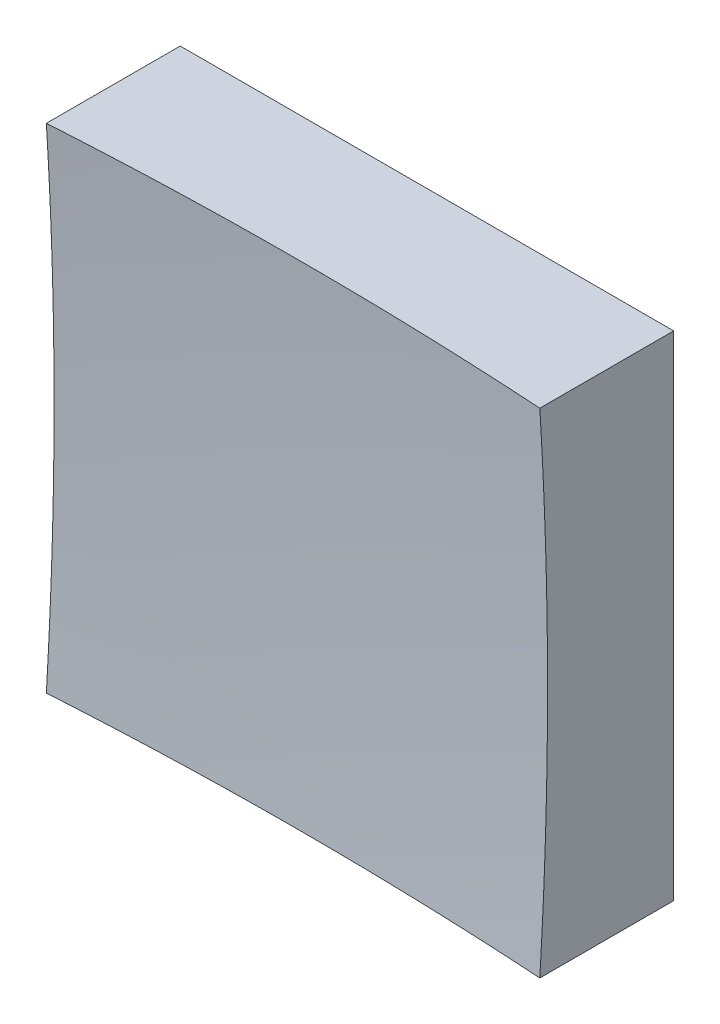
ISO-10303-21;
HEADER;
FILE_DESCRIPTION(('STEP AP214'),'2;1');
FILE_NAME('part.step','',(''),(''),'','','');
FILE_SCHEMA(('AUTOMOTIVE_DESIGN { 1 0 10303 214 1 1 1 1 }'));
ENDSEC;
DATA;
#1=APPLICATION_CONTEXT('core data for automotive mechanical design processes');
#2=APPLICATION_PROTOCOL_DEFINITION('international standard','automotive_design',2000,#1);
#3=PRODUCT_CONTEXT('',#1,'mechanical');
#4=PRODUCT('Part','Part','',(#3));
#5=PRODUCT_RELATED_PRODUCT_CATEGORY('part','',(#4));
#6=PRODUCT_DEFINITION_FORMATION('','',#4);
#7=PRODUCT_DEFINITION_CONTEXT('part definition',#1,'design');
#8=PRODUCT_DEFINITION('design','',#6,#7);
#9=PRODUCT_DEFINITION_SHAPE('','',#8);
#10=(LENGTH_UNIT() NAMED_UNIT(*) SI_UNIT(.MILLI.,.METRE.));
#11=(NAMED_UNIT(*) PLANE_ANGLE_UNIT() SI_UNIT($,.RADIAN.));
#12=(NAMED_UNIT(*) SI_UNIT($,.STERADIAN.) SOLID_ANGLE_UNIT());
#13=UNCERTAINTY_MEASURE_WITH_UNIT(LENGTH_MEASURE(1.E-05),#10,'distance_accuracy_value','');
#14=(GEOMETRIC_REPRESENTATION_CONTEXT(3) GLOBAL_UNCERTAINTY_ASSIGNED_CONTEXT((#13)) GLOBAL_UNIT_ASSIGNED_CONTEXT((#10,
#11,#12)) REPRESENTATION_CONTEXT('',''));
#15=CARTESIAN_POINT('',(0.,0.,0.));
#16=DIRECTION('',(0.,0.,1.));
#17=DIRECTION('',(1.,0.,0.));
#18=AXIS2_PLACEMENT_3D('',#15,#16,#17);
#19=CARTESIAN_POINT('',(-12.5,12.5,20.));
#20=DIRECTION('',(0.,1.,0.));
#21=DIRECTION('',(0.,0.,1.));
#22=AXIS2_PLACEMENT_3D('',#19,#20,#21);
#23=PLANE('',#22);
#24=CARTESIAN_POINT('',(0.,12.5,206.));
#25=DIRECTION('',(0.,1.,0.));
#26=DIRECTION('',(0.,0.,1.));
#27=AXIS2_PLACEMENT_3D('',#24,#25,#26);
#28=CIRCLE('',#27,199.608992783391);
#29=CARTESIAN_POINT('',(12.5,12.5,6.78278186863465));
#30=VERTEX_POINT('',#29);
#31=CARTESIAN_POINT('',(-12.5,12.5,6.78278186863465));
#32=VERTEX_POINT('',#31);
#33=EDGE_CURVE('E79',#30,#32,#28,.T.);
#34=ORIENTED_EDGE('',*,*,#33,.F.);
#35=DIRECTION('',(0.,0.,-1.));
#36=VECTOR('',#35,1.);
#37=CARTESIAN_POINT('',(12.5,12.5,20.));
#38=LINE('',#37,#36);
#39=CARTESIAN_POINT('',(12.5,12.5,0.));
#40=VERTEX_POINT('',#39);
#41=EDGE_CURVE('E85',#30,#40,#38,.T.);
#42=ORIENTED_EDGE('',*,*,#41,.T.);
#43=DIRECTION('',(1.,0.,0.));
#44=VECTOR('',#43,1.);
#45=CARTESIAN_POINT('',(-12.5,12.5,0.));
#46=LINE('',#45,#44);
#47=CARTESIAN_POINT('',(-12.5,12.5,0.));
#48=VERTEX_POINT('',#47);
#49=EDGE_CURVE('E88',#48,#40,#46,.T.);
#50=ORIENTED_EDGE('',*,*,#49,.F.);
#51=DIRECTION('',(0.,0.,-1.));
#52=VECTOR('',#51,1.);
#53=CARTESIAN_POINT('',(-12.5,12.5,20.));
#54=LINE('',#53,#52);
#55=EDGE_CURVE('E47',#32,#48,#54,.T.);
#56=ORIENTED_EDGE('',*,*,#55,.F.);
#57=EDGE_LOOP('',(#34,#42,#50,#56));
#58=FACE_BOUND('',#57,.T.);
#59=ADVANCED_FACE('F39',(#58),#23,.T.);
#60=CARTESIAN_POINT('',(-12.5,12.5,20.));
#61=DIRECTION('',(1.,0.,0.));
#62=DIRECTION('',(0.,1.,0.));
#63=AXIS2_PLACEMENT_3D('',#60,#61,#62);
#64=PLANE('',#63);
#65=DIRECTION('',(0.,0.,-1.));
#66=VECTOR('',#65,1.);
#67=CARTESIAN_POINT('',(-12.5,-12.5,20.));
#68=LINE('',#67,#66);
#69=CARTESIAN_POINT('',(-12.5,-12.5,6.78278186863465));
#70=VERTEX_POINT('',#69);
#71=CARTESIAN_POINT('',(-12.5,-12.5,0.));
#72=VERTEX_POINT('',#71);
#73=EDGE_CURVE('E100',#70,#72,#68,.T.);
#74=ORIENTED_EDGE('',*,*,#73,.F.);
#75=CARTESIAN_POINT('',(-12.5,0.,206.));
#76=DIRECTION('',(1.,0.,0.));
#77=DIRECTION('',(0.,1.,0.));
#78=AXIS2_PLACEMENT_3D('',#75,#76,#77);
#79=CIRCLE('',#78,199.608992783391);
#80=EDGE_CURVE('E89',#70,#32,#79,.T.);
#81=ORIENTED_EDGE('',*,*,#80,.T.);
#82=ORIENTED_EDGE('',*,*,#55,.T.);
#83=DIRECTION('',(0.,-1.,0.));
#84=VECTOR('',#83,1.);
#85=CARTESIAN_POINT('',(-12.5,12.5,0.));
#86=LINE('',#85,#84);
#87=EDGE_CURVE('E97',#48,#72,#86,.T.);
#88=ORIENTED_EDGE('',*,*,#87,.T.);
#89=EDGE_LOOP('',(#74,#81,#82,#88));
#90=FACE_BOUND('',#89,.T.);
#91=ADVANCED_FACE('F122',(#90),#64,.F.);
#92=CARTESIAN_POINT('',(-12.5,-12.5,20.));
#93=DIRECTION('',(0.,1.,0.));
#94=DIRECTION('',(0.,0.,1.));
#95=AXIS2_PLACEMENT_3D('',#92,#93,#94);
#96=PLANE('',#95);
#97=DIRECTION('',(0.,0.,-1.));
#98=VECTOR('',#97,1.);
#99=CARTESIAN_POINT('',(12.5,-12.5,20.));
#100=LINE('',#99,#98);
#101=CARTESIAN_POINT('',(12.5,-12.5,6.78278186863465));
#102=VERTEX_POINT('',#101);
#103=CARTESIAN_POINT('',(12.5,-12.5,0.));
#104=VERTEX_POINT('',#103);
#105=EDGE_CURVE('E96',#102,#104,#100,.T.);
#106=ORIENTED_EDGE('',*,*,#105,.F.);
#107=CARTESIAN_POINT('',(0.,-12.5,206.));
#108=DIRECTION('',(0.,1.,0.));
#109=DIRECTION('',(0.,0.,1.));
#110=AXIS2_PLACEMENT_3D('',#107,#108,#109);
#111=CIRCLE('',#110,199.608992783391);
#112=EDGE_CURVE('E53',#102,#70,#111,.T.);
#113=ORIENTED_EDGE('',*,*,#112,.T.);
#114=ORIENTED_EDGE('',*,*,#73,.T.);
#115=DIRECTION('',(1.,0.,0.));
#116=VECTOR('',#115,1.);
#117=CARTESIAN_POINT('',(-12.5,-12.5,0.));
#118=LINE('',#117,#116);
#119=EDGE_CURVE('E102',#72,#104,#118,.T.);
#120=ORIENTED_EDGE('',*,*,#119,.T.);
#121=EDGE_LOOP('',(#106,#113,#114,#120));
#122=FACE_BOUND('',#121,.T.);
#123=ADVANCED_FACE('F121',(#122),#96,.F.);
#124=CARTESIAN_POINT('',(12.5,12.5,20.));
#125=DIRECTION('',(1.,0.,0.));
#126=DIRECTION('',(0.,1.,0.));
#127=AXIS2_PLACEMENT_3D('',#124,#125,#126);
#128=PLANE('',#127);
#129=CARTESIAN_POINT('',(12.5,0.,206.));
#130=DIRECTION('',(1.,0.,0.));
#131=DIRECTION('',(0.,1.,0.));
#132=AXIS2_PLACEMENT_3D('',#129,#130,#131);
#133=CIRCLE('',#132,199.608992783391);
#134=EDGE_CURVE('E11',#102,#30,#133,.T.);
#135=ORIENTED_EDGE('',*,*,#134,.F.);
#136=ORIENTED_EDGE('',*,*,#105,.T.);
#137=DIRECTION('',(0.,-1.,0.));
#138=VECTOR('',#137,1.);
#139=CARTESIAN_POINT('',(12.5,12.5,0.));
#140=LINE('',#139,#138);
#141=EDGE_CURVE('E93',#40,#104,#140,.T.);
#142=ORIENTED_EDGE('',*,*,#141,.F.);
#143=ORIENTED_EDGE('',*,*,#41,.F.);
#144=EDGE_LOOP('',(#135,#136,#142,#143));
#145=FACE_BOUND('',#144,.T.);
#146=ADVANCED_FACE('F91',(#145),#128,.T.);
#147=CARTESIAN_POINT('',(0.,0.,0.));
#148=DIRECTION('',(0.,0.,-1.));
#149=DIRECTION('',(-1.,0.,0.));
#150=AXIS2_PLACEMENT_3D('',#147,#148,#149);
#151=PLANE('',#150);
#152=ORIENTED_EDGE('',*,*,#49,.T.);
#153=ORIENTED_EDGE('',*,*,#141,.T.);
#154=ORIENTED_EDGE('',*,*,#119,.F.);
#155=ORIENTED_EDGE('',*,*,#87,.F.);
#156=EDGE_LOOP('',(#152,#153,#154,#155));
#157=FACE_BOUND('',#156,.T.);
#158=ADVANCED_FACE('F125',(#157),#151,.T.);
#159=CARTESIAN_POINT('',(0.,0.,206.));
#160=DIRECTION('',(0.,0.,1.));
#161=DIRECTION('',(1.,0.,0.));
#162=AXIS2_PLACEMENT_3D('',#159,#160,#161);
#163=SPHERICAL_SURFACE('',#162,200.);
#164=ORIENTED_EDGE('',*,*,#33,.T.);
#165=ORIENTED_EDGE('',*,*,#80,.F.);
#166=ORIENTED_EDGE('',*,*,#112,.F.);
#167=ORIENTED_EDGE('',*,*,#134,.T.);
#168=EDGE_LOOP('',(#164,#165,#166,#167));
#169=FACE_BOUND('',#168,.T.);
#170=ADVANCED_FACE('F78',(#169),#163,.F.);
#171=CLOSED_SHELL('',(#59,#91,#123,#146,#158,#170));
#172=MANIFOLD_SOLID_BREP('B2',#171);
#173=ADVANCED_BREP_SHAPE_REPRESENTATION('',(#18,#172),#14);
#174=SHAPE_DEFINITION_REPRESENTATION(#9,#173);
ENDSEC;
END-ISO-10303-21;
